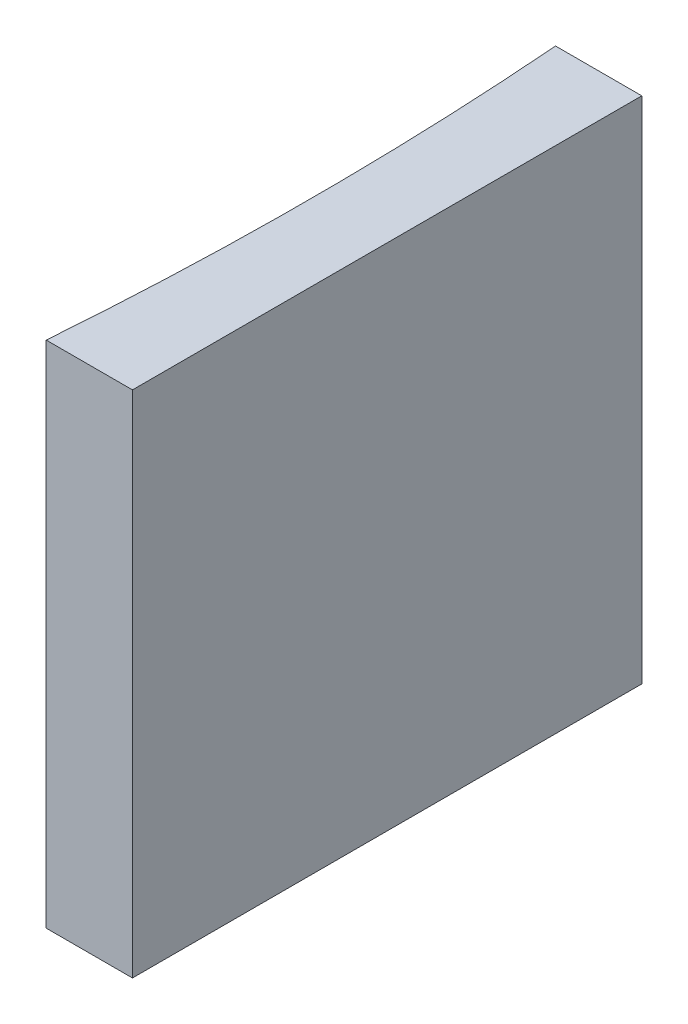
ISO-10303-21;
HEADER;
FILE_DESCRIPTION(('STEP AP214'),'2;1');
FILE_NAME('part.step','',(''),(''),'','','');
FILE_SCHEMA(('AUTOMOTIVE_DESIGN { 1 0 10303 214 1 1 1 1 }'));
ENDSEC;
DATA;
#1=APPLICATION_CONTEXT('core data for automotive mechanical design processes');
#2=APPLICATION_PROTOCOL_DEFINITION('international standard','automotive_design',2000,#1);
#3=PRODUCT_CONTEXT('',#1,'mechanical');
#4=PRODUCT('Part','Part','',(#3));
#5=PRODUCT_RELATED_PRODUCT_CATEGORY('part','',(#4));
#6=PRODUCT_DEFINITION_FORMATION('','',#4);
#7=PRODUCT_DEFINITION_CONTEXT('part definition',#1,'design');
#8=PRODUCT_DEFINITION('design','',#6,#7);
#9=PRODUCT_DEFINITION_SHAPE('','',#8);
#10=(LENGTH_UNIT() NAMED_UNIT(*) SI_UNIT(.MILLI.,.METRE.));
#11=(NAMED_UNIT(*) PLANE_ANGLE_UNIT() SI_UNIT($,.RADIAN.));
#12=(NAMED_UNIT(*) SI_UNIT($,.STERADIAN.) SOLID_ANGLE_UNIT());
#13=UNCERTAINTY_MEASURE_WITH_UNIT(LENGTH_MEASURE(1.E-05),#10,'distance_accuracy_value','');
#14=(GEOMETRIC_REPRESENTATION_CONTEXT(3) GLOBAL_UNCERTAINTY_ASSIGNED_CONTEXT((#13)) GLOBAL_UNIT_ASSIGNED_CONTEXT((#10,
#11,#12)) REPRESENTATION_CONTEXT('',''));
#15=CARTESIAN_POINT('',(0.,0.,0.));
#16=DIRECTION('',(0.,0.,1.));
#17=DIRECTION('',(1.,0.,0.));
#18=AXIS2_PLACEMENT_3D('',#15,#16,#17);
#19=CARTESIAN_POINT('',(0.,20.,0.));
#20=DIRECTION('',(0.,0.,1.));
#21=DIRECTION('',(1.,0.,0.));
#22=AXIS2_PLACEMENT_3D('',#19,#20,#21);
#23=PLANE('',#22);
#24=DIRECTION('',(-1.,0.,0.));
#25=VECTOR('',#24,1.);
#26=CARTESIAN_POINT('',(0.,0.,0.));
#27=LINE('',#26,#25);
#28=CARTESIAN_POINT('',(0.,0.,0.));
#29=VERTEX_POINT('',#28);
#30=CARTESIAN_POINT('',(-3.38742785432225,0.,0.));
#31=VERTEX_POINT('',#30);
#32=EDGE_CURVE('E100',#29,#31,#27,.T.);
#33=ORIENTED_EDGE('',*,*,#32,.T.);
#34=DIRECTION('',(0.,-1.,0.));
#35=VECTOR('',#34,1.);
#36=CARTESIAN_POINT('',(-3.38742785432225,20.,0.));
#37=LINE('',#36,#35);
#38=CARTESIAN_POINT('',(-3.38742785432225,20.,0.));
#39=VERTEX_POINT('',#38);
#40=EDGE_CURVE('E11',#39,#31,#37,.T.);
#41=ORIENTED_EDGE('',*,*,#40,.F.);
#42=DIRECTION('',(-1.,0.,0.));
#43=VECTOR('',#42,1.);
#44=CARTESIAN_POINT('',(0.,20.,0.));
#45=LINE('',#44,#43);
#46=CARTESIAN_POINT('',(0.,20.,0.));
#47=VERTEX_POINT('',#46);
#48=EDGE_CURVE('E88',#47,#39,#45,.T.);
#49=ORIENTED_EDGE('',*,*,#48,.F.);
#50=DIRECTION('',(0.,-1.,0.));
#51=VECTOR('',#50,1.);
#52=CARTESIAN_POINT('',(0.,20.,0.));
#53=LINE('',#52,#51);
#54=EDGE_CURVE('E96',#47,#29,#53,.T.);
#55=ORIENTED_EDGE('',*,*,#54,.T.);
#56=EDGE_LOOP('',(#33,#41,#49,#55));
#57=FACE_BOUND('',#56,.T.);
#58=ADVANCED_FACE('F37',(#57),#23,.F.);
#59=CARTESIAN_POINT('',(-132.25,20.,10.));
#60=DIRECTION('',(0.,-1.,0.));
#61=DIRECTION('',(0.,0.,-1.));
#62=AXIS2_PLACEMENT_3D('',#59,#60,#61);
#63=CYLINDRICAL_SURFACE('',#62,129.25);
#64=CARTESIAN_POINT('',(-132.25,0.,10.));
#65=DIRECTION('',(0.,-1.,0.));
#66=DIRECTION('',(0.,0.,1.));
#67=AXIS2_PLACEMENT_3D('',#64,#65,#66);
#68=CIRCLE('',#67,129.25);
#69=CARTESIAN_POINT('',(-3.38742785432225,0.,20.));
#70=VERTEX_POINT('',#69);
#71=EDGE_CURVE('E92',#31,#70,#68,.T.);
#72=ORIENTED_EDGE('',*,*,#71,.T.);
#73=DIRECTION('',(0.,-1.,0.));
#74=VECTOR('',#73,1.);
#75=CARTESIAN_POINT('',(-3.38742785432225,20.,20.));
#76=LINE('',#75,#74);
#77=CARTESIAN_POINT('',(-3.38742785432225,20.,20.));
#78=VERTEX_POINT('',#77);
#79=EDGE_CURVE('E45',#78,#70,#76,.T.);
#80=ORIENTED_EDGE('',*,*,#79,.F.);
#81=CARTESIAN_POINT('',(-132.25,20.,10.));
#82=DIRECTION('',(0.,-1.,0.));
#83=DIRECTION('',(0.,0.,1.));
#84=AXIS2_PLACEMENT_3D('',#81,#82,#83);
#85=CIRCLE('',#84,129.25);
#86=EDGE_CURVE('E83',#39,#78,#85,.T.);
#87=ORIENTED_EDGE('',*,*,#86,.F.);
#88=ORIENTED_EDGE('',*,*,#40,.T.);
#89=EDGE_LOOP('',(#72,#80,#87,#88));
#90=FACE_BOUND('',#89,.T.);
#91=ADVANCED_FACE('F91',(#90),#63,.F.);
#92=CARTESIAN_POINT('',(0.,20.,20.));
#93=DIRECTION('',(0.,0.,-1.));
#94=DIRECTION('',(-1.,0.,0.));
#95=AXIS2_PLACEMENT_3D('',#92,#93,#94);
#96=PLANE('',#95);
#97=DIRECTION('',(1.,0.,0.));
#98=VECTOR('',#97,1.);
#99=CARTESIAN_POINT('',(0.,0.,20.));
#100=LINE('',#99,#98);
#101=CARTESIAN_POINT('',(0.,0.,20.));
#102=VERTEX_POINT('',#101);
#103=EDGE_CURVE('E70',#70,#102,#100,.T.);
#104=ORIENTED_EDGE('',*,*,#103,.T.);
#105=DIRECTION('',(0.,-1.,0.));
#106=VECTOR('',#105,1.);
#107=CARTESIAN_POINT('',(0.,20.,20.));
#108=LINE('',#107,#106);
#109=CARTESIAN_POINT('',(0.,20.,20.));
#110=VERTEX_POINT('',#109);
#111=EDGE_CURVE('E93',#110,#102,#108,.T.);
#112=ORIENTED_EDGE('',*,*,#111,.F.);
#113=DIRECTION('',(1.,0.,0.));
#114=VECTOR('',#113,1.);
#115=CARTESIAN_POINT('',(0.,20.,20.));
#116=LINE('',#115,#114);
#117=EDGE_CURVE('E86',#78,#110,#116,.T.);
#118=ORIENTED_EDGE('',*,*,#117,.F.);
#119=ORIENTED_EDGE('',*,*,#79,.T.);
#120=EDGE_LOOP('',(#104,#112,#118,#119));
#121=FACE_BOUND('',#120,.T.);
#122=ADVANCED_FACE('F94',(#121),#96,.F.);
#123=CARTESIAN_POINT('',(0.,20.,0.));
#124=DIRECTION('',(-1.,0.,0.));
#125=DIRECTION('',(0.,0.,1.));
#126=AXIS2_PLACEMENT_3D('',#123,#124,#125);
#127=PLANE('',#126);
#128=DIRECTION('',(0.,0.,-1.));
#129=VECTOR('',#128,1.);
#130=CARTESIAN_POINT('',(0.,0.,0.));
#131=LINE('',#130,#129);
#132=EDGE_CURVE('E76',#102,#29,#131,.T.);
#133=ORIENTED_EDGE('',*,*,#132,.T.);
#134=ORIENTED_EDGE('',*,*,#54,.F.);
#135=DIRECTION('',(0.,0.,-1.));
#136=VECTOR('',#135,1.);
#137=CARTESIAN_POINT('',(0.,20.,0.));
#138=LINE('',#137,#136);
#139=EDGE_CURVE('E53',#110,#47,#138,.T.);
#140=ORIENTED_EDGE('',*,*,#139,.F.);
#141=ORIENTED_EDGE('',*,*,#111,.T.);
#142=EDGE_LOOP('',(#133,#134,#140,#141));
#143=FACE_BOUND('',#142,.T.);
#144=ADVANCED_FACE('F107',(#143),#127,.F.);
#145=CARTESIAN_POINT('',(-132.25,20.,10.));
#146=DIRECTION('',(0.,1.,0.));
#147=DIRECTION('',(0.,0.,1.));
#148=AXIS2_PLACEMENT_3D('',#145,#146,#147);
#149=PLANE('',#148);
#150=ORIENTED_EDGE('',*,*,#48,.T.);
#151=ORIENTED_EDGE('',*,*,#86,.T.);
#152=ORIENTED_EDGE('',*,*,#117,.T.);
#153=ORIENTED_EDGE('',*,*,#139,.T.);
#154=EDGE_LOOP('',(#150,#151,#152,#153));
#155=FACE_BOUND('',#154,.T.);
#156=ADVANCED_FACE('F84',(#155),#149,.T.);
#157=CARTESIAN_POINT('',(-132.25,0.,10.));
#158=DIRECTION('',(0.,1.,0.));
#159=DIRECTION('',(0.,0.,1.));
#160=AXIS2_PLACEMENT_3D('',#157,#158,#159);
#161=PLANE('',#160);
#162=ORIENTED_EDGE('',*,*,#32,.F.);
#163=ORIENTED_EDGE('',*,*,#132,.F.);
#164=ORIENTED_EDGE('',*,*,#103,.F.);
#165=ORIENTED_EDGE('',*,*,#71,.F.);
#166=EDGE_LOOP('',(#162,#163,#164,#165));
#167=FACE_BOUND('',#166,.T.);
#168=ADVANCED_FACE('F110',(#167),#161,.F.);
#169=CLOSED_SHELL('',(#58,#91,#122,#144,#156,#168));
#170=MANIFOLD_SOLID_BREP('B2',#169);
#171=ADVANCED_BREP_SHAPE_REPRESENTATION('',(#18,#170),#14);
#172=SHAPE_DEFINITION_REPRESENTATION(#9,#171);
ENDSEC;
END-ISO-10303-21;
